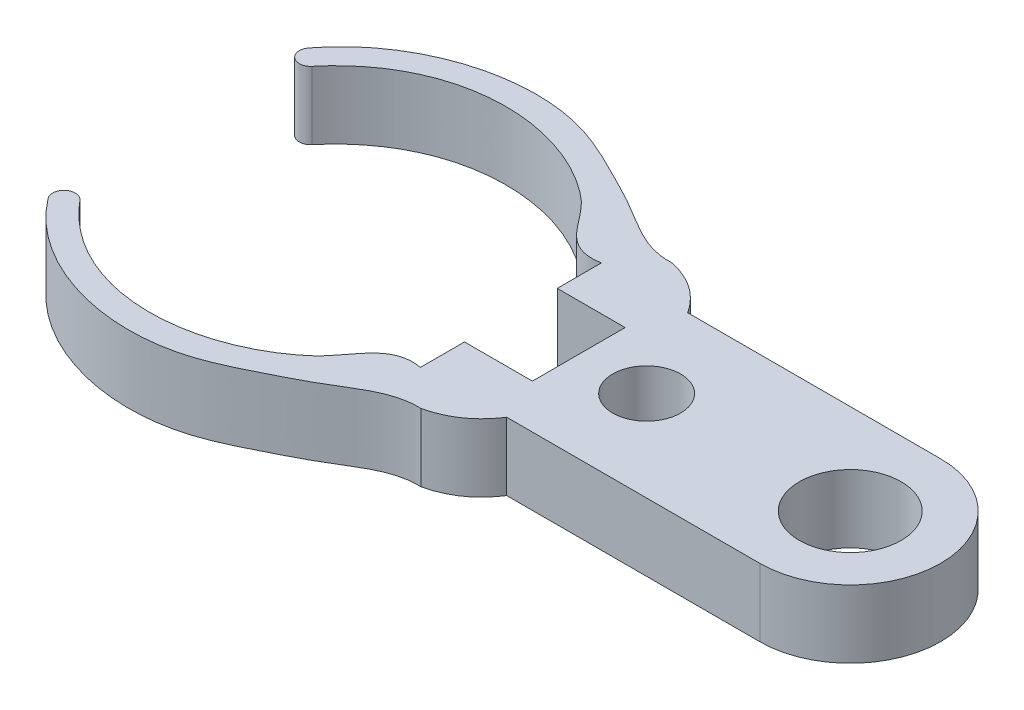
ISO-10303-21;
HEADER;
FILE_DESCRIPTION(('STEP AP214'),'2;1');
FILE_NAME('part.step','',(''),(''),'','','');
FILE_SCHEMA(('AUTOMOTIVE_DESIGN { 1 0 10303 214 1 1 1 1 }'));
ENDSEC;
DATA;
#1=APPLICATION_CONTEXT('core data for automotive mechanical design processes');
#2=APPLICATION_PROTOCOL_DEFINITION('international standard','automotive_design',2000,#1);
#3=PRODUCT_CONTEXT('',#1,'mechanical');
#4=PRODUCT('Part','Part','',(#3));
#5=PRODUCT_RELATED_PRODUCT_CATEGORY('part','',(#4));
#6=PRODUCT_DEFINITION_FORMATION('','',#4);
#7=PRODUCT_DEFINITION_CONTEXT('part definition',#1,'design');
#8=PRODUCT_DEFINITION('design','',#6,#7);
#9=PRODUCT_DEFINITION_SHAPE('','',#8);
#10=(LENGTH_UNIT() NAMED_UNIT(*) SI_UNIT(.MILLI.,.METRE.));
#11=(NAMED_UNIT(*) PLANE_ANGLE_UNIT() SI_UNIT($,.RADIAN.));
#12=(NAMED_UNIT(*) SI_UNIT($,.STERADIAN.) SOLID_ANGLE_UNIT());
#13=UNCERTAINTY_MEASURE_WITH_UNIT(LENGTH_MEASURE(1.E-05),#10,'distance_accuracy_value','');
#14=(GEOMETRIC_REPRESENTATION_CONTEXT(3) GLOBAL_UNCERTAINTY_ASSIGNED_CONTEXT((#13)) GLOBAL_UNIT_ASSIGNED_CONTEXT((#10,
#11,#12)) REPRESENTATION_CONTEXT('',''));
#15=CARTESIAN_POINT('',(0.,0.,0.));
#16=DIRECTION('',(0.,0.,1.));
#17=DIRECTION('',(1.,0.,0.));
#18=AXIS2_PLACEMENT_3D('',#15,#16,#17);
#19=CARTESIAN_POINT('',(15.,3.,-4.));
#20=DIRECTION('',(0.,-1.,0.));
#21=DIRECTION('',(0.,0.,-1.));
#22=AXIS2_PLACEMENT_3D('',#19,#20,#21);
#23=CYLINDRICAL_SURFACE('',#22,4.);
#24=CARTESIAN_POINT('',(15.,0.,-4.));
#25=DIRECTION('',(0.,1.,0.));
#26=DIRECTION('',(0.,0.,1.));
#27=AXIS2_PLACEMENT_3D('',#24,#25,#26);
#28=CIRCLE('',#27,4.);
#29=CARTESIAN_POINT('',(15.,0.,-8.));
#30=VERTEX_POINT('',#29);
#31=CARTESIAN_POINT('',(15.,0.,0.));
#32=VERTEX_POINT('',#31);
#33=EDGE_CURVE('E290',#30,#32,#28,.F.);
#34=ORIENTED_EDGE('',*,*,#33,.F.);
#35=DIRECTION('',(0.,-1.,0.));
#36=VECTOR('',#35,1.);
#37=CARTESIAN_POINT('',(15.,3.,-8.));
#38=LINE('',#37,#36);
#39=CARTESIAN_POINT('',(15.,3.,-8.));
#40=VERTEX_POINT('',#39);
#41=EDGE_CURVE('E11',#40,#30,#38,.T.);
#42=ORIENTED_EDGE('',*,*,#41,.F.);
#43=CARTESIAN_POINT('',(15.,3.,-4.));
#44=DIRECTION('',(0.,1.,0.));
#45=DIRECTION('',(0.,0.,1.));
#46=AXIS2_PLACEMENT_3D('',#43,#44,#45);
#47=CIRCLE('',#46,4.);
#48=CARTESIAN_POINT('',(15.,3.,0.));
#49=VERTEX_POINT('',#48);
#50=EDGE_CURVE('E377',#40,#49,#47,.F.);
#51=ORIENTED_EDGE('',*,*,#50,.T.);
#52=DIRECTION('',(0.,-1.,0.));
#53=VECTOR('',#52,1.);
#54=CARTESIAN_POINT('',(15.,3.,0.));
#55=LINE('',#54,#53);
#56=EDGE_CURVE('E119',#49,#32,#55,.T.);
#57=ORIENTED_EDGE('',*,*,#56,.T.);
#58=EDGE_LOOP('',(#34,#42,#51,#57));
#59=FACE_BOUND('',#58,.T.);
#60=ADVANCED_FACE('F43',(#59),#23,.T.);
#61=CARTESIAN_POINT('',(0.,3.,-8.));
#62=DIRECTION('',(0.,0.,-1.));
#63=DIRECTION('',(-1.,0.,0.));
#64=AXIS2_PLACEMENT_3D('',#61,#62,#63);
#65=PLANE('',#64);
#66=DIRECTION('',(1.,0.,0.));
#67=VECTOR('',#66,1.);
#68=CARTESIAN_POINT('',(0.,0.,-8.));
#69=LINE('',#68,#67);
#70=CARTESIAN_POINT('',(3.81249630151308,0.,-8.));
#71=VERTEX_POINT('',#70);
#72=EDGE_CURVE('E285',#71,#30,#69,.T.);
#73=ORIENTED_EDGE('',*,*,#72,.F.);
#74=DIRECTION('',(0.,-1.,0.));
#75=VECTOR('',#74,1.);
#76=CARTESIAN_POINT('',(3.81249630151308,3.,-8.));
#77=LINE('',#76,#75);
#78=CARTESIAN_POINT('',(3.81249630151308,3.,-8.));
#79=VERTEX_POINT('',#78);
#80=EDGE_CURVE('E52',#79,#71,#77,.T.);
#81=ORIENTED_EDGE('',*,*,#80,.F.);
#82=DIRECTION('',(1.,0.,0.));
#83=VECTOR('',#82,1.);
#84=CARTESIAN_POINT('',(0.,3.,-8.));
#85=LINE('',#84,#83);
#86=EDGE_CURVE('E426',#79,#40,#85,.T.);
#87=ORIENTED_EDGE('',*,*,#86,.T.);
#88=ORIENTED_EDGE('',*,*,#41,.T.);
#89=EDGE_LOOP('',(#73,#81,#87,#88));
#90=FACE_BOUND('',#89,.T.);
#91=ADVANCED_FACE('F286',(#90),#65,.T.);
#92=CARTESIAN_POINT('',(1.579778316785,3.,-9.56066150238347));
#93=CARTESIAN_POINT('',(3.01637188256581,3.,-9.23196193005216));
#94=CARTESIAN_POINT('',(3.81249630151308,3.,-8.));
#95=B_SPLINE_CURVE_WITH_KNOTS('',2,(#92,#93,#94),.UNSPECIFIED.,.F.,.F.,(3,3),(0.,1.),.UNSPECIFIED.);
#96=DIRECTION('',(0.,-1.,0.));
#97=VECTOR('',#96,1.);
#98=SURFACE_OF_LINEAR_EXTRUSION('',#95,#97);
#99=CARTESIAN_POINT('',(1.579778316785,0.,-9.56066150238347));
#100=CARTESIAN_POINT('',(3.01637188256581,0.,-9.23196193005216));
#101=CARTESIAN_POINT('',(3.81249630151308,0.,-8.));
#102=B_SPLINE_CURVE_WITH_KNOTS('',2,(#99,#100,#101),.UNSPECIFIED.,.F.,.F.,(3,3),(0.,1.),.UNSPECIFIED.);
#103=CARTESIAN_POINT('',(1.579778316785,0.,-9.56066150238347));
#104=VERTEX_POINT('',#103);
#105=EDGE_CURVE('E277',#104,#71,#102,.T.);
#106=ORIENTED_EDGE('',*,*,#105,.F.);
#107=DIRECTION('',(0.,-1.,0.));
#108=VECTOR('',#107,1.);
#109=CARTESIAN_POINT('',(1.579778316785,3.,-9.56066150238347));
#110=LINE('',#109,#108);
#111=CARTESIAN_POINT('',(1.579778316785,3.,-9.56066150238347));
#112=VERTEX_POINT('',#111);
#113=EDGE_CURVE('E268',#112,#104,#110,.T.);
#114=ORIENTED_EDGE('',*,*,#113,.F.);
#115=EDGE_CURVE('E280',#112,#79,#95,.T.);
#116=ORIENTED_EDGE('',*,*,#115,.T.);
#117=ORIENTED_EDGE('',*,*,#80,.T.);
#118=EDGE_LOOP('',(#106,#114,#116,#117));
#119=FACE_BOUND('',#118,.T.);
#120=ADVANCED_FACE('F275',(#119),#98,.T.);
#121=CARTESIAN_POINT('',(-14.6796449934747,3.,-9.77947622002646));
#122=CARTESIAN_POINT('',(-12.6288944529096,3.,-12.4740809792739));
#123=CARTESIAN_POINT('',(-7.71429631155653,3.,-13.951404509586));
#124=CARTESIAN_POINT('',(-3.34534030952829,3.,-11.740062440401));
#125=CARTESIAN_POINT('',(-1.00563164103133,3.,-10.5601854078919));
#126=CARTESIAN_POINT('',(0.39459532488585,3.,-9.50115309346869));
#127=CARTESIAN_POINT('',(1.579778316785,3.,-9.56066150238347));
#128=B_SPLINE_CURVE_WITH_KNOTS('',3,(#121,#122,#123,#124,#125,#126,#127),.UNSPECIFIED.,.F.,.F.,
(4,1,1,1,4),(0.,0.557352672097069,0.711946672573447,0.815566184702698,1.),.UNSPECIFIED.);
#129=DIRECTION('',(0.,-1.,0.));
#130=VECTOR('',#129,1.);
#131=SURFACE_OF_LINEAR_EXTRUSION('',#128,#130);
#132=CARTESIAN_POINT('',(-14.6796449934747,0.,-9.77947622002646));
#133=CARTESIAN_POINT('',(-12.6288944529096,0.,-12.4740809792739));
#134=CARTESIAN_POINT('',(-7.71429631155653,0.,-13.951404509586));
#135=CARTESIAN_POINT('',(-3.34534030952829,0.,-11.740062440401));
#136=CARTESIAN_POINT('',(-1.00563164103133,0.,-10.5601854078919));
#137=CARTESIAN_POINT('',(0.39459532488585,0.,-9.50115309346869));
#138=CARTESIAN_POINT('',(1.579778316785,0.,-9.56066150238347));
#139=B_SPLINE_CURVE_WITH_KNOTS('',3,(#132,#133,#134,#135,#136,#137,#138),.UNSPECIFIED.,.F.,.F.,
(4,1,1,1,4),(0.,0.557352672097069,0.711946672573447,0.815566184702698,1.),.UNSPECIFIED.);
#140=CARTESIAN_POINT('',(-14.6796449934747,0.,-9.77947622002647));
#141=VERTEX_POINT('',#140);
#142=EDGE_CURVE('E296',#141,#104,#139,.T.);
#143=ORIENTED_EDGE('',*,*,#142,.F.);
#144=DIRECTION('',(0.,-1.,0.));
#145=VECTOR('',#144,1.);
#146=CARTESIAN_POINT('',(-14.6796449934747,3.,-9.77947622002647));
#147=LINE('',#146,#145);
#148=CARTESIAN_POINT('',(-14.6796449934747,3.,-9.77947622002647));
#149=VERTEX_POINT('',#148);
#150=EDGE_CURVE('E265',#149,#141,#147,.T.);
#151=ORIENTED_EDGE('',*,*,#150,.F.);
#152=EDGE_CURVE('E425',#149,#112,#128,.T.);
#153=ORIENTED_EDGE('',*,*,#152,.T.);
#154=ORIENTED_EDGE('',*,*,#113,.T.);
#155=EDGE_LOOP('',(#143,#151,#153,#154));
#156=FACE_BOUND('',#155,.T.);
#157=ADVANCED_FACE('F414',(#156),#131,.T.);
#158=CARTESIAN_POINT('',(-14.301533041483,3.,-9.45231975629542));
#159=DIRECTION('',(0.,-1.,0.));
#160=DIRECTION('',(0.,0.,-1.));
#161=AXIS2_PLACEMENT_3D('',#158,#159,#160);
#162=CYLINDRICAL_SURFACE('',#161,0.499999999999999);
#163=CARTESIAN_POINT('',(-14.301533041483,0.,-9.45231975629542));
#164=DIRECTION('',(0.,1.,0.));
#165=DIRECTION('',(0.,0.,1.));
#166=AXIS2_PLACEMENT_3D('',#163,#164,#165);
#167=CIRCLE('',#166,0.499999999999999);
#168=CARTESIAN_POINT('',(-13.9234210894912,0.,-9.12516329256437));
#169=VERTEX_POINT('',#168);
#170=EDGE_CURVE('E300',#141,#169,#167,.T.);
#171=ORIENTED_EDGE('',*,*,#170,.T.);
#172=DIRECTION('',(0.,-1.,0.));
#173=VECTOR('',#172,1.);
#174=CARTESIAN_POINT('',(-13.9234210894912,3.,-9.12516329256437));
#175=LINE('',#174,#173);
#176=CARTESIAN_POINT('',(-13.9234210894912,3.,-9.12516329256437));
#177=VERTEX_POINT('',#176);
#178=EDGE_CURVE('E262',#177,#169,#175,.T.);
#179=ORIENTED_EDGE('',*,*,#178,.F.);
#180=CARTESIAN_POINT('',(-14.301533041483,3.,-9.45231975629542));
#181=DIRECTION('',(0.,1.,0.));
#182=DIRECTION('',(0.,0.,1.));
#183=AXIS2_PLACEMENT_3D('',#180,#181,#182);
#184=CIRCLE('',#183,0.499999999999999);
#185=EDGE_CURVE('E437',#149,#177,#184,.T.);
#186=ORIENTED_EDGE('',*,*,#185,.F.);
#187=ORIENTED_EDGE('',*,*,#150,.T.);
#188=EDGE_LOOP('',(#171,#179,#186,#187));
#189=FACE_BOUND('',#188,.T.);
#190=ADVANCED_FACE('F460',(#189),#162,.T.);
#191=CARTESIAN_POINT('',(0.,3.,-8.));
#192=CARTESIAN_POINT('',(-1.44497211346419,3.,-7.73163506053914));
#193=CARTESIAN_POINT('',(-1.98977866941509,3.,-9.27479361128934));
#194=CARTESIAN_POINT('',(-5.99641861973722,3.,-12.5324767542509));
#195=CARTESIAN_POINT('',(-11.0435793264746,3.,-12.5964127519181));
#196=CARTESIAN_POINT('',(-13.9234210894912,3.,-9.12516329256436));
#197=B_SPLINE_CURVE_WITH_KNOTS('',3,(#191,#192,#193,#194,#195,#196),.UNSPECIFIED.,.F.,.F.,(4,1,
1,4),(0.,0.216898357421302,0.270831115761617,1.),.UNSPECIFIED.);
#198=DIRECTION('',(0.,-1.,0.));
#199=VECTOR('',#198,1.);
#200=SURFACE_OF_LINEAR_EXTRUSION('',#197,#199);
#201=CARTESIAN_POINT('',(0.,0.,-8.));
#202=CARTESIAN_POINT('',(-1.44497211346419,0.,-7.73163506053914));
#203=CARTESIAN_POINT('',(-1.98977866941509,0.,-9.27479361128934));
#204=CARTESIAN_POINT('',(-5.99641861973722,0.,-12.5324767542509));
#205=CARTESIAN_POINT('',(-11.0435793264746,0.,-12.5964127519181));
#206=CARTESIAN_POINT('',(-13.9234210894912,0.,-9.12516329256436));
#207=B_SPLINE_CURVE_WITH_KNOTS('',3,(#201,#202,#203,#204,#205,#206),.UNSPECIFIED.,.F.,.F.,(4,1,
1,4),(0.,0.216898357421302,0.270831115761617,1.),.UNSPECIFIED.);
#208=CARTESIAN_POINT('',(0.,0.,-8.));
#209=VERTEX_POINT('',#208);
#210=EDGE_CURVE('E317',#209,#169,#207,.T.);
#211=ORIENTED_EDGE('',*,*,#210,.F.);
#212=DIRECTION('',(0.,-1.,0.));
#213=VECTOR('',#212,1.);
#214=CARTESIAN_POINT('',(0.,3.,-8.));
#215=LINE('',#214,#213);
#216=CARTESIAN_POINT('',(0.,3.,-8.));
#217=VERTEX_POINT('',#216);
#218=EDGE_CURVE('E259',#217,#209,#215,.T.);
#219=ORIENTED_EDGE('',*,*,#218,.F.);
#220=EDGE_CURVE('E443',#217,#177,#197,.T.);
#221=ORIENTED_EDGE('',*,*,#220,.T.);
#222=ORIENTED_EDGE('',*,*,#178,.T.);
#223=EDGE_LOOP('',(#211,#219,#221,#222));
#224=FACE_BOUND('',#223,.T.);
#225=ADVANCED_FACE('F456',(#224),#200,.T.);
#226=CARTESIAN_POINT('',(0.,3.,0.));
#227=DIRECTION('',(-1.,0.,0.));
#228=DIRECTION('',(0.,0.,1.));
#229=AXIS2_PLACEMENT_3D('',#226,#227,#228);
#230=PLANE('',#229);
#231=DIRECTION('',(0.,0.,-1.));
#232=VECTOR('',#231,1.);
#233=CARTESIAN_POINT('',(0.,0.,0.));
#234=LINE('',#233,#232);
#235=CARTESIAN_POINT('',(0.,0.,-6.05));
#236=VERTEX_POINT('',#235);
#237=EDGE_CURVE('E323',#236,#209,#234,.T.);
#238=ORIENTED_EDGE('',*,*,#237,.F.);
#239=DIRECTION('',(0.,-1.,0.));
#240=VECTOR('',#239,1.);
#241=CARTESIAN_POINT('',(0.,3.,-6.05));
#242=LINE('',#241,#240);
#243=CARTESIAN_POINT('',(0.,3.,-6.05));
#244=VERTEX_POINT('',#243);
#245=EDGE_CURVE('E256',#244,#236,#242,.T.);
#246=ORIENTED_EDGE('',*,*,#245,.F.);
#247=DIRECTION('',(0.,0.,-1.));
#248=VECTOR('',#247,1.);
#249=CARTESIAN_POINT('',(0.,3.,0.));
#250=LINE('',#249,#248);
#251=EDGE_CURVE('E450',#244,#217,#250,.T.);
#252=ORIENTED_EDGE('',*,*,#251,.T.);
#253=ORIENTED_EDGE('',*,*,#218,.T.);
#254=EDGE_LOOP('',(#238,#246,#252,#253));
#255=FACE_BOUND('',#254,.T.);
#256=ADVANCED_FACE('F459',(#255),#230,.T.);
#257=CARTESIAN_POINT('',(0.,3.,-6.05));
#258=DIRECTION('',(0.,0.,-1.));
#259=DIRECTION('',(-1.,0.,0.));
#260=AXIS2_PLACEMENT_3D('',#257,#258,#259);
#261=PLANE('',#260);
#262=DIRECTION('',(1.,0.,0.));
#263=VECTOR('',#262,1.);
#264=CARTESIAN_POINT('',(0.,0.,-6.05));
#265=LINE('',#264,#263);
#266=CARTESIAN_POINT('',(3.,0.,-6.05));
#267=VERTEX_POINT('',#266);
#268=EDGE_CURVE('E330',#236,#267,#265,.T.);
#269=ORIENTED_EDGE('',*,*,#268,.T.);
#270=DIRECTION('',(0.,-1.,0.));
#271=VECTOR('',#270,1.);
#272=CARTESIAN_POINT('',(3.,3.,-6.05));
#273=LINE('',#272,#271);
#274=CARTESIAN_POINT('',(3.,3.,-6.05));
#275=VERTEX_POINT('',#274);
#276=EDGE_CURVE('E252',#275,#267,#273,.T.);
#277=ORIENTED_EDGE('',*,*,#276,.F.);
#278=DIRECTION('',(1.,0.,0.));
#279=VECTOR('',#278,1.);
#280=CARTESIAN_POINT('',(0.,3.,-6.05));
#281=LINE('',#280,#279);
#282=EDGE_CURVE('E482',#244,#275,#281,.T.);
#283=ORIENTED_EDGE('',*,*,#282,.F.);
#284=ORIENTED_EDGE('',*,*,#245,.T.);
#285=EDGE_LOOP('',(#269,#277,#283,#284));
#286=FACE_BOUND('',#285,.T.);
#287=ADVANCED_FACE('F462',(#286),#261,.F.);
#288=CARTESIAN_POINT('',(3.,3.,0.));
#289=DIRECTION('',(1.,0.,0.));
#290=DIRECTION('',(0.,0.,-1.));
#291=AXIS2_PLACEMENT_3D('',#288,#289,#290);
#292=PLANE('',#291);
#293=DIRECTION('',(0.,0.,1.));
#294=VECTOR('',#293,1.);
#295=CARTESIAN_POINT('',(3.,0.,0.));
#296=LINE('',#295,#294);
#297=CARTESIAN_POINT('',(3.,0.,-1.95));
#298=VERTEX_POINT('',#297);
#299=EDGE_CURVE('E334',#267,#298,#296,.T.);
#300=ORIENTED_EDGE('',*,*,#299,.T.);
#301=DIRECTION('',(0.,-1.,0.));
#302=VECTOR('',#301,1.);
#303=CARTESIAN_POINT('',(3.,3.,-1.95));
#304=LINE('',#303,#302);
#305=CARTESIAN_POINT('',(3.,3.,-1.95));
#306=VERTEX_POINT('',#305);
#307=EDGE_CURVE('E249',#306,#298,#304,.T.);
#308=ORIENTED_EDGE('',*,*,#307,.F.);
#309=DIRECTION('',(0.,0.,1.));
#310=VECTOR('',#309,1.);
#311=CARTESIAN_POINT('',(3.,3.,0.));
#312=LINE('',#311,#310);
#313=EDGE_CURVE('E484',#275,#306,#312,.T.);
#314=ORIENTED_EDGE('',*,*,#313,.F.);
#315=ORIENTED_EDGE('',*,*,#276,.T.);
#316=EDGE_LOOP('',(#300,#308,#314,#315));
#317=FACE_BOUND('',#316,.T.);
#318=ADVANCED_FACE('F498',(#317),#292,.F.);
#319=CARTESIAN_POINT('',(0.,3.,-1.95));
#320=DIRECTION('',(0.,0.,-1.));
#321=DIRECTION('',(-1.,0.,0.));
#322=AXIS2_PLACEMENT_3D('',#319,#320,#321);
#323=PLANE('',#322);
#324=DIRECTION('',(1.,0.,0.));
#325=VECTOR('',#324,1.);
#326=CARTESIAN_POINT('',(0.,0.,-1.95));
#327=LINE('',#326,#325);
#328=CARTESIAN_POINT('',(0.,0.,-1.95));
#329=VERTEX_POINT('',#328);
#330=EDGE_CURVE('E338',#329,#298,#327,.T.);
#331=ORIENTED_EDGE('',*,*,#330,.F.);
#332=DIRECTION('',(0.,-1.,0.));
#333=VECTOR('',#332,1.);
#334=CARTESIAN_POINT('',(0.,3.,-1.95));
#335=LINE('',#334,#333);
#336=CARTESIAN_POINT('',(0.,3.,-1.95));
#337=VERTEX_POINT('',#336);
#338=EDGE_CURVE('E246',#337,#329,#335,.T.);
#339=ORIENTED_EDGE('',*,*,#338,.F.);
#340=DIRECTION('',(1.,0.,0.));
#341=VECTOR('',#340,1.);
#342=CARTESIAN_POINT('',(0.,3.,-1.95));
#343=LINE('',#342,#341);
#344=EDGE_CURVE('E225',#337,#306,#343,.T.);
#345=ORIENTED_EDGE('',*,*,#344,.T.);
#346=ORIENTED_EDGE('',*,*,#307,.T.);
#347=EDGE_LOOP('',(#331,#339,#345,#346));
#348=FACE_BOUND('',#347,.T.);
#349=ADVANCED_FACE('F501',(#348),#323,.T.);
#350=CARTESIAN_POINT('',(0.,0.,0.));
#351=VERTEX_POINT('',#350);
#352=EDGE_CURVE('E331',#351,#329,#234,.T.);
#353=ORIENTED_EDGE('',*,*,#352,.F.);
#354=DIRECTION('',(0.,-1.,0.));
#355=VECTOR('',#354,1.);
#356=CARTESIAN_POINT('',(0.,3.,0.));
#357=LINE('',#356,#355);
#358=CARTESIAN_POINT('',(0.,3.,0.));
#359=VERTEX_POINT('',#358);
#360=EDGE_CURVE('E240',#359,#351,#357,.T.);
#361=ORIENTED_EDGE('',*,*,#360,.F.);
#362=EDGE_CURVE('E224',#359,#337,#250,.T.);
#363=ORIENTED_EDGE('',*,*,#362,.T.);
#364=ORIENTED_EDGE('',*,*,#338,.T.);
#365=EDGE_LOOP('',(#353,#361,#363,#364));
#366=FACE_BOUND('',#365,.T.);
#367=ADVANCED_FACE('F215',(#366),#230,.T.);
#368=CARTESIAN_POINT('',(0.,3.,0.));
#369=CARTESIAN_POINT('',(-1.44497211346419,3.,-0.268364939460864));
#370=CARTESIAN_POINT('',(-1.98977866941509,3.,1.27479361128934));
#371=CARTESIAN_POINT('',(-5.99641861973722,3.,4.53247675425091));
#372=CARTESIAN_POINT('',(-11.0435793264746,3.,4.59641275191809));
#373=CARTESIAN_POINT('',(-13.9234210894912,3.,1.12516329256436));
#374=B_SPLINE_CURVE_WITH_KNOTS('',3,(#368,#369,#370,#371,#372,#373),.UNSPECIFIED.,.F.,.F.,(4,1,
1,4),(0.,0.216898357421302,0.270831115761617,1.),.UNSPECIFIED.);
#375=DIRECTION('',(0.,-1.,0.));
#376=VECTOR('',#375,1.);
#377=SURFACE_OF_LINEAR_EXTRUSION('',#374,#376);
#378=CARTESIAN_POINT('',(0.,0.,0.));
#379=CARTESIAN_POINT('',(-1.44497211346419,0.,-0.268364939460864));
#380=CARTESIAN_POINT('',(-1.98977866941509,0.,1.27479361128934));
#381=CARTESIAN_POINT('',(-5.99641861973722,0.,4.53247675425091));
#382=CARTESIAN_POINT('',(-11.0435793264746,0.,4.59641275191809));
#383=CARTESIAN_POINT('',(-13.9234210894912,0.,1.12516329256436));
#384=B_SPLINE_CURVE_WITH_KNOTS('',3,(#378,#379,#380,#381,#382,#383),.UNSPECIFIED.,.F.,.F.,(4,1,
1,4),(0.,0.216898357421302,0.270831115761617,1.),.UNSPECIFIED.);
#385=CARTESIAN_POINT('',(-13.9234210894912,0.,1.12516329256438));
#386=VERTEX_POINT('',#385);
#387=EDGE_CURVE('E342',#351,#386,#384,.T.);
#388=ORIENTED_EDGE('',*,*,#387,.T.);
#389=DIRECTION('',(0.,-1.,0.));
#390=VECTOR('',#389,1.);
#391=CARTESIAN_POINT('',(-13.9234210894912,3.,1.12516329256438));
#392=LINE('',#391,#390);
#393=CARTESIAN_POINT('',(-13.9234210894912,3.,1.12516329256438));
#394=VERTEX_POINT('',#393);
#395=EDGE_CURVE('E233',#394,#386,#392,.T.);
#396=ORIENTED_EDGE('',*,*,#395,.F.);
#397=EDGE_CURVE('E218',#359,#394,#374,.T.);
#398=ORIENTED_EDGE('',*,*,#397,.F.);
#399=ORIENTED_EDGE('',*,*,#360,.T.);
#400=EDGE_LOOP('',(#388,#396,#398,#399));
#401=FACE_BOUND('',#400,.T.);
#402=ADVANCED_FACE('F210',(#401),#377,.F.);
#403=CARTESIAN_POINT('',(-14.301533041483,3.,1.45231975629542));
#404=DIRECTION('',(0.,-1.,0.));
#405=DIRECTION('',(0.,0.,-1.));
#406=AXIS2_PLACEMENT_3D('',#403,#404,#405);
#407=CYLINDRICAL_SURFACE('',#406,0.499999999999999);
#408=CARTESIAN_POINT('',(-14.301533041483,0.,1.45231975629542));
#409=DIRECTION('',(0.,1.,0.));
#410=DIRECTION('',(0.,0.,1.));
#411=AXIS2_PLACEMENT_3D('',#408,#409,#410);
#412=CIRCLE('',#411,0.499999999999999);
#413=CARTESIAN_POINT('',(-14.6796449934747,0.,1.77947622002647));
#414=VERTEX_POINT('',#413);
#415=EDGE_CURVE('E236',#414,#386,#412,.F.);
#416=ORIENTED_EDGE('',*,*,#415,.F.);
#417=DIRECTION('',(0.,-1.,0.));
#418=VECTOR('',#417,1.);
#419=CARTESIAN_POINT('',(-14.6796449934747,3.,1.77947622002647));
#420=LINE('',#419,#418);
#421=CARTESIAN_POINT('',(-14.6796449934747,3.,1.77947622002647));
#422=VERTEX_POINT('',#421);
#423=EDGE_CURVE('E178',#422,#414,#420,.T.);
#424=ORIENTED_EDGE('',*,*,#423,.F.);
#425=CARTESIAN_POINT('',(-14.301533041483,3.,1.45231975629542));
#426=DIRECTION('',(0.,1.,0.));
#427=DIRECTION('',(0.,0.,1.));
#428=AXIS2_PLACEMENT_3D('',#425,#426,#427);
#429=CIRCLE('',#428,0.499999999999999);
#430=EDGE_CURVE('E169',#422,#394,#429,.F.);
#431=ORIENTED_EDGE('',*,*,#430,.T.);
#432=ORIENTED_EDGE('',*,*,#395,.T.);
#433=EDGE_LOOP('',(#416,#424,#431,#432));
#434=FACE_BOUND('',#433,.T.);
#435=ADVANCED_FACE('F207',(#434),#407,.T.);
#436=CARTESIAN_POINT('',(-14.6796449934747,3.,1.77947622002646));
#437=CARTESIAN_POINT('',(-12.6288944529096,3.,4.4740809792739));
#438=CARTESIAN_POINT('',(-7.71429631155654,3.,5.95140450958604));
#439=CARTESIAN_POINT('',(-3.34534030952829,3.,3.74006244040104));
#440=CARTESIAN_POINT('',(-1.00563164103133,3.,2.56018540789194));
#441=CARTESIAN_POINT('',(0.39459532488585,3.,1.50115309346869));
#442=CARTESIAN_POINT('',(1.579778316785,3.,1.56066150238347));
#443=B_SPLINE_CURVE_WITH_KNOTS('',3,(#436,#437,#438,#439,#440,#441,#442),.UNSPECIFIED.,.F.,.F.,
(4,1,1,1,4),(0.,0.557352672097069,0.711946672573447,0.815566184702698,1.),.UNSPECIFIED.);
#444=DIRECTION('',(0.,-1.,0.));
#445=VECTOR('',#444,1.);
#446=SURFACE_OF_LINEAR_EXTRUSION('',#443,#445);
#447=CARTESIAN_POINT('',(-14.6796449934747,0.,1.77947622002646));
#448=CARTESIAN_POINT('',(-12.6288944529096,0.,4.4740809792739));
#449=CARTESIAN_POINT('',(-7.71429631155654,0.,5.95140450958604));
#450=CARTESIAN_POINT('',(-3.34534030952829,0.,3.74006244040104));
#451=CARTESIAN_POINT('',(-1.00563164103133,0.,2.56018540789194));
#452=CARTESIAN_POINT('',(0.39459532488585,0.,1.50115309346869));
#453=CARTESIAN_POINT('',(1.579778316785,0.,1.56066150238347));
#454=B_SPLINE_CURVE_WITH_KNOTS('',3,(#447,#448,#449,#450,#451,#452,#453),.UNSPECIFIED.,.F.,.F.,
(4,1,1,1,4),(0.,0.557352672097069,0.711946672573447,0.815566184702698,1.),.UNSPECIFIED.);
#455=CARTESIAN_POINT('',(1.579778316785,0.,1.56066150238347));
#456=VERTEX_POINT('',#455);
#457=EDGE_CURVE('E176',#414,#456,#454,.T.);
#458=ORIENTED_EDGE('',*,*,#457,.T.);
#459=DIRECTION('',(0.,-1.,0.));
#460=VECTOR('',#459,1.);
#461=CARTESIAN_POINT('',(1.579778316785,3.,1.56066150238347));
#462=LINE('',#461,#460);
#463=CARTESIAN_POINT('',(1.579778316785,3.,1.56066150238347));
#464=VERTEX_POINT('',#463);
#465=EDGE_CURVE('E173',#464,#456,#462,.T.);
#466=ORIENTED_EDGE('',*,*,#465,.F.);
#467=EDGE_CURVE('E162',#422,#464,#443,.T.);
#468=ORIENTED_EDGE('',*,*,#467,.F.);
#469=ORIENTED_EDGE('',*,*,#423,.T.);
#470=EDGE_LOOP('',(#458,#466,#468,#469));
#471=FACE_BOUND('',#470,.T.);
#472=ADVANCED_FACE('F174',(#471),#446,.F.);
#473=CARTESIAN_POINT('',(1.579778316785,3.,1.56066150238347));
#474=CARTESIAN_POINT('',(3.01637188256581,3.,1.23196193005216));
#475=CARTESIAN_POINT('',(3.81249630151308,3.,0.));
#476=B_SPLINE_CURVE_WITH_KNOTS('',2,(#473,#474,#475),.UNSPECIFIED.,.F.,.F.,(3,3),(0.,1.),.UNSPECIFIED.);
#477=DIRECTION('',(0.,-1.,0.));
#478=VECTOR('',#477,1.);
#479=SURFACE_OF_LINEAR_EXTRUSION('',#476,#478);
#480=CARTESIAN_POINT('',(1.579778316785,0.,1.56066150238347));
#481=CARTESIAN_POINT('',(3.01637188256581,0.,1.23196193005216));
#482=CARTESIAN_POINT('',(3.81249630151308,0.,0.));
#483=B_SPLINE_CURVE_WITH_KNOTS('',2,(#480,#481,#482),.UNSPECIFIED.,.F.,.F.,(3,3),(0.,1.),.UNSPECIFIED.);
#484=CARTESIAN_POINT('',(3.81249630151308,0.,0.));
#485=VERTEX_POINT('',#484);
#486=EDGE_CURVE('E112',#456,#485,#483,.T.);
#487=ORIENTED_EDGE('',*,*,#486,.T.);
#488=DIRECTION('',(0.,-1.,0.));
#489=VECTOR('',#488,1.);
#490=CARTESIAN_POINT('',(3.81249630151308,3.,0.));
#491=LINE('',#490,#489);
#492=CARTESIAN_POINT('',(3.81249630151308,3.,0.));
#493=VERTEX_POINT('',#492);
#494=EDGE_CURVE('E179',#493,#485,#491,.T.);
#495=ORIENTED_EDGE('',*,*,#494,.F.);
#496=EDGE_CURVE('E167',#464,#493,#476,.T.);
#497=ORIENTED_EDGE('',*,*,#496,.F.);
#498=ORIENTED_EDGE('',*,*,#465,.T.);
#499=EDGE_LOOP('',(#487,#495,#497,#498));
#500=FACE_BOUND('',#499,.T.);
#501=ADVANCED_FACE('F181',(#500),#479,.F.);
#502=CARTESIAN_POINT('',(15.,3.,-4.));
#503=DIRECTION('',(0.,-1.,0.));
#504=DIRECTION('',(0.,0.,-1.));
#505=AXIS2_PLACEMENT_3D('',#502,#503,#504);
#506=CYLINDRICAL_SURFACE('',#505,2.25);
#507=CARTESIAN_POINT('',(15.,3.,-4.));
#508=DIRECTION('',(0.,1.,0.));
#509=DIRECTION('',(0.,0.,1.));
#510=AXIS2_PLACEMENT_3D('',#507,#508,#509);
#511=CIRCLE('',#510,2.25);
#512=CARTESIAN_POINT('',(15.,3.,-1.75));
#513=VERTEX_POINT('',#512);
#514=EDGE_CURVE('E185',#513,#513,#511,.T.);
#515=ORIENTED_EDGE('',*,*,#514,.T.);
#516=EDGE_LOOP('',(#515));
#517=FACE_BOUND('',#516,.T.);
#518=CARTESIAN_POINT('',(15.,0.,-4.));
#519=DIRECTION('',(0.,1.,0.));
#520=DIRECTION('',(0.,0.,1.));
#521=AXIS2_PLACEMENT_3D('',#518,#519,#520);
#522=CIRCLE('',#521,2.25);
#523=CARTESIAN_POINT('',(15.,0.,-1.75));
#524=VERTEX_POINT('',#523);
#525=EDGE_CURVE('E369',#524,#524,#522,.T.);
#526=ORIENTED_EDGE('',*,*,#525,.F.);
#527=EDGE_LOOP('',(#526));
#528=FACE_BOUND('',#527,.T.);
#529=ADVANCED_FACE('F202',(#517,#528),#506,.F.);
#530=CARTESIAN_POINT('',(0.,3.,0.));
#531=DIRECTION('',(0.,0.,-1.));
#532=DIRECTION('',(-1.,0.,0.));
#533=AXIS2_PLACEMENT_3D('',#530,#531,#532);
#534=PLANE('',#533);
#535=DIRECTION('',(1.,0.,0.));
#536=VECTOR('',#535,1.);
#537=CARTESIAN_POINT('',(0.,0.,0.));
#538=LINE('',#537,#536);
#539=EDGE_CURVE('E363',#485,#32,#538,.T.);
#540=ORIENTED_EDGE('',*,*,#539,.T.);
#541=ORIENTED_EDGE('',*,*,#56,.F.);
#542=DIRECTION('',(1.,0.,0.));
#543=VECTOR('',#542,1.);
#544=CARTESIAN_POINT('',(0.,3.,0.));
#545=LINE('',#544,#543);
#546=EDGE_CURVE('E60',#493,#49,#545,.T.);
#547=ORIENTED_EDGE('',*,*,#546,.F.);
#548=ORIENTED_EDGE('',*,*,#494,.T.);
#549=EDGE_LOOP('',(#540,#541,#547,#548));
#550=FACE_BOUND('',#549,.T.);
#551=ADVANCED_FACE('F203',(#550),#534,.F.);
#552=CARTESIAN_POINT('',(6.,3.,-4.));
#553=DIRECTION('',(0.,-1.,0.));
#554=DIRECTION('',(0.,0.,-1.));
#555=AXIS2_PLACEMENT_3D('',#552,#553,#554);
#556=CYLINDRICAL_SURFACE('',#555,1.5);
#557=CARTESIAN_POINT('',(6.,3.,-4.));
#558=DIRECTION('',(0.,1.,0.));
#559=DIRECTION('',(0.,0.,1.));
#560=AXIS2_PLACEMENT_3D('',#557,#558,#559);
#561=CIRCLE('',#560,1.5);
#562=CARTESIAN_POINT('',(6.,3.,-2.5));
#563=VERTEX_POINT('',#562);
#564=EDGE_CURVE('E379',#563,#563,#561,.T.);
#565=ORIENTED_EDGE('',*,*,#564,.T.);
#566=EDGE_LOOP('',(#565));
#567=FACE_BOUND('',#566,.T.);
#568=CARTESIAN_POINT('',(6.,0.,-4.));
#569=DIRECTION('',(0.,1.,0.));
#570=DIRECTION('',(0.,0.,1.));
#571=AXIS2_PLACEMENT_3D('',#568,#569,#570);
#572=CIRCLE('',#571,1.5);
#573=CARTESIAN_POINT('',(6.,0.,-2.5));
#574=VERTEX_POINT('',#573);
#575=EDGE_CURVE('E373',#574,#574,#572,.T.);
#576=ORIENTED_EDGE('',*,*,#575,.F.);
#577=EDGE_LOOP('',(#576));
#578=FACE_BOUND('',#577,.T.);
#579=ADVANCED_FACE('F394',(#567,#578),#556,.F.);
#580=CARTESIAN_POINT('',(0.,3.,0.));
#581=DIRECTION('',(0.,1.,0.));
#582=DIRECTION('',(0.,0.,1.));
#583=AXIS2_PLACEMENT_3D('',#580,#581,#582);
#584=PLANE('',#583);
#585=ORIENTED_EDGE('',*,*,#50,.F.);
#586=ORIENTED_EDGE('',*,*,#86,.F.);
#587=ORIENTED_EDGE('',*,*,#115,.F.);
#588=ORIENTED_EDGE('',*,*,#152,.F.);
#589=ORIENTED_EDGE('',*,*,#185,.T.);
#590=ORIENTED_EDGE('',*,*,#220,.F.);
#591=ORIENTED_EDGE('',*,*,#251,.F.);
#592=ORIENTED_EDGE('',*,*,#282,.T.);
#593=ORIENTED_EDGE('',*,*,#313,.T.);
#594=ORIENTED_EDGE('',*,*,#344,.F.);
#595=ORIENTED_EDGE('',*,*,#362,.F.);
#596=ORIENTED_EDGE('',*,*,#397,.T.);
#597=ORIENTED_EDGE('',*,*,#430,.F.);
#598=ORIENTED_EDGE('',*,*,#467,.T.);
#599=ORIENTED_EDGE('',*,*,#496,.T.);
#600=ORIENTED_EDGE('',*,*,#546,.T.);
#601=EDGE_LOOP('',(#585,#586,#587,#588,#589,#590,#591,#592,#593,#594,#595,#596,#597,#598,#599,#600));
#602=FACE_BOUND('',#601,.T.);
#603=ORIENTED_EDGE('',*,*,#514,.F.);
#604=EDGE_LOOP('',(#603));
#605=FACE_BOUND('',#604,.T.);
#606=ORIENTED_EDGE('',*,*,#564,.F.);
#607=EDGE_LOOP('',(#606));
#608=FACE_BOUND('',#607,.T.);
#609=ADVANCED_FACE('F164',(#602,#605,#608),#584,.T.);
#610=CARTESIAN_POINT('',(0.,0.,0.));
#611=DIRECTION('',(0.,1.,0.));
#612=DIRECTION('',(0.,0.,1.));
#613=AXIS2_PLACEMENT_3D('',#610,#611,#612);
#614=PLANE('',#613);
#615=ORIENTED_EDGE('',*,*,#33,.T.);
#616=ORIENTED_EDGE('',*,*,#539,.F.);
#617=ORIENTED_EDGE('',*,*,#486,.F.);
#618=ORIENTED_EDGE('',*,*,#457,.F.);
#619=ORIENTED_EDGE('',*,*,#415,.T.);
#620=ORIENTED_EDGE('',*,*,#387,.F.);
#621=ORIENTED_EDGE('',*,*,#352,.T.);
#622=ORIENTED_EDGE('',*,*,#330,.T.);
#623=ORIENTED_EDGE('',*,*,#299,.F.);
#624=ORIENTED_EDGE('',*,*,#268,.F.);
#625=ORIENTED_EDGE('',*,*,#237,.T.);
#626=ORIENTED_EDGE('',*,*,#210,.T.);
#627=ORIENTED_EDGE('',*,*,#170,.F.);
#628=ORIENTED_EDGE('',*,*,#142,.T.);
#629=ORIENTED_EDGE('',*,*,#105,.T.);
#630=ORIENTED_EDGE('',*,*,#72,.T.);
#631=EDGE_LOOP('',(#615,#616,#617,#618,#619,#620,#621,#622,#623,#624,#625,#626,#627,#628,#629,#630));
#632=FACE_BOUND('',#631,.T.);
#633=ORIENTED_EDGE('',*,*,#525,.T.);
#634=EDGE_LOOP('',(#633));
#635=FACE_BOUND('',#634,.T.);
#636=ORIENTED_EDGE('',*,*,#575,.T.);
#637=EDGE_LOOP('',(#636));
#638=FACE_BOUND('',#637,.T.);
#639=ADVANCED_FACE('F292',(#632,#635,#638),#614,.F.);
#640=CLOSED_SHELL('',(#60,#91,#120,#157,#190,#225,#256,#287,#318,#349,#367,#402,#435,#472,#501,
#529,#551,#579,#609,#639));
#641=MANIFOLD_SOLID_BREP('B2',#640);
#642=ADVANCED_BREP_SHAPE_REPRESENTATION('',(#18,#641),#14);
#643=SHAPE_DEFINITION_REPRESENTATION(#9,#642);
ENDSEC;
END-ISO-10303-21;
